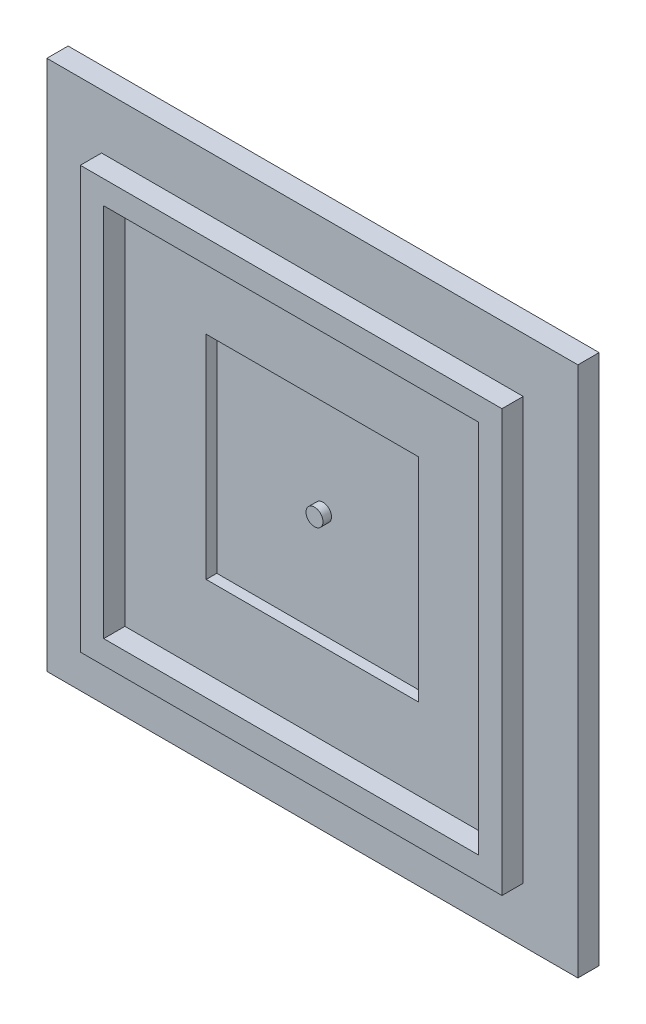
ISO-10303-21;
HEADER;
FILE_DESCRIPTION(('STEP AP214'),'2;1');
FILE_NAME('part.step','',(''),(''),'','','');
FILE_SCHEMA(('AUTOMOTIVE_DESIGN { 1 0 10303 214 1 1 1 1 }'));
ENDSEC;
DATA;
#1=APPLICATION_CONTEXT('core data for automotive mechanical design processes');
#2=APPLICATION_PROTOCOL_DEFINITION('international standard','automotive_design',2000,#1);
#3=PRODUCT_CONTEXT('',#1,'mechanical');
#4=PRODUCT('Part','Part','',(#3));
#5=PRODUCT_RELATED_PRODUCT_CATEGORY('part','',(#4));
#6=PRODUCT_DEFINITION_FORMATION('','',#4);
#7=PRODUCT_DEFINITION_CONTEXT('part definition',#1,'design');
#8=PRODUCT_DEFINITION('design','',#6,#7);
#9=PRODUCT_DEFINITION_SHAPE('','',#8);
#10=(LENGTH_UNIT() NAMED_UNIT(*) SI_UNIT(.MILLI.,.METRE.));
#11=(NAMED_UNIT(*) PLANE_ANGLE_UNIT() SI_UNIT($,.RADIAN.));
#12=(NAMED_UNIT(*) SI_UNIT($,.STERADIAN.) SOLID_ANGLE_UNIT());
#13=UNCERTAINTY_MEASURE_WITH_UNIT(LENGTH_MEASURE(1.E-05),#10,'distance_accuracy_value','');
#14=(GEOMETRIC_REPRESENTATION_CONTEXT(3) GLOBAL_UNCERTAINTY_ASSIGNED_CONTEXT((#13)) GLOBAL_UNIT_ASSIGNED_CONTEXT((#10,
#11,#12)) REPRESENTATION_CONTEXT('',''));
#15=CARTESIAN_POINT('',(0.,0.,0.));
#16=DIRECTION('',(0.,0.,1.));
#17=DIRECTION('',(1.,0.,0.));
#18=AXIS2_PLACEMENT_3D('',#15,#16,#17);
#19=CARTESIAN_POINT('',(0.,0.,0.));
#20=DIRECTION('',(0.,0.,-1.));
#21=DIRECTION('',(-1.,0.,0.));
#22=AXIS2_PLACEMENT_3D('',#19,#20,#21);
#23=PLANE('',#22);
#24=DIRECTION('',(0.,-1.,0.));
#25=VECTOR('',#24,1.);
#26=CARTESIAN_POINT('',(-63.5,63.5,0.));
#27=LINE('',#26,#25);
#28=CARTESIAN_POINT('',(-63.5,63.5,0.));
#29=VERTEX_POINT('',#28);
#30=CARTESIAN_POINT('',(-63.5,-63.5,0.));
#31=VERTEX_POINT('',#30);
#32=EDGE_CURVE('E250',#29,#31,#27,.T.);
#33=ORIENTED_EDGE('',*,*,#32,.T.);
#34=DIRECTION('',(1.,0.,0.));
#35=VECTOR('',#34,1.);
#36=CARTESIAN_POINT('',(63.5,-63.5,0.));
#37=LINE('',#36,#35);
#38=CARTESIAN_POINT('',(63.5,-63.5,0.));
#39=VERTEX_POINT('',#38);
#40=EDGE_CURVE('E267',#31,#39,#37,.T.);
#41=ORIENTED_EDGE('',*,*,#40,.T.);
#42=DIRECTION('',(0.,1.,0.));
#43=VECTOR('',#42,1.);
#44=CARTESIAN_POINT('',(63.5,63.5,0.));
#45=LINE('',#44,#43);
#46=CARTESIAN_POINT('',(63.5,63.5,0.));
#47=VERTEX_POINT('',#46);
#48=EDGE_CURVE('E270',#39,#47,#45,.T.);
#49=ORIENTED_EDGE('',*,*,#48,.T.);
#50=DIRECTION('',(-1.,0.,0.));
#51=VECTOR('',#50,1.);
#52=CARTESIAN_POINT('',(63.5,63.5,0.));
#53=LINE('',#52,#51);
#54=EDGE_CURVE('E255',#47,#29,#53,.T.);
#55=ORIENTED_EDGE('',*,*,#54,.T.);
#56=EDGE_LOOP('',(#33,#41,#49,#55));
#57=FACE_BOUND('',#56,.T.);
#58=DIRECTION('',(1.,0.,0.));
#59=VECTOR('',#58,1.);
#60=CARTESIAN_POINT('',(-50.419,-50.419,0.));
#61=LINE('',#60,#59);
#62=CARTESIAN_POINT('',(-50.419,-50.419,0.));
#63=VERTEX_POINT('',#62);
#64=CARTESIAN_POINT('',(50.419,-50.419,0.));
#65=VERTEX_POINT('',#64);
#66=EDGE_CURVE('E215',#63,#65,#61,.T.);
#67=ORIENTED_EDGE('',*,*,#66,.F.);
#68=DIRECTION('',(0.,-1.,0.));
#69=VECTOR('',#68,1.);
#70=CARTESIAN_POINT('',(-50.419,50.419,0.));
#71=LINE('',#70,#69);
#72=CARTESIAN_POINT('',(-50.419,50.419,0.));
#73=VERTEX_POINT('',#72);
#74=EDGE_CURVE('E224',#73,#63,#71,.T.);
#75=ORIENTED_EDGE('',*,*,#74,.F.);
#76=DIRECTION('',(1.,0.,0.));
#77=VECTOR('',#76,1.);
#78=CARTESIAN_POINT('',(-50.419,50.419,0.));
#79=LINE('',#78,#77);
#80=CARTESIAN_POINT('',(50.419,50.419,0.));
#81=VERTEX_POINT('',#80);
#82=EDGE_CURVE('E237',#73,#81,#79,.T.);
#83=ORIENTED_EDGE('',*,*,#82,.T.);
#84=DIRECTION('',(0.,-1.,0.));
#85=VECTOR('',#84,1.);
#86=CARTESIAN_POINT('',(50.419,50.419,0.));
#87=LINE('',#86,#85);
#88=EDGE_CURVE('E234',#81,#65,#87,.T.);
#89=ORIENTED_EDGE('',*,*,#88,.T.);
#90=EDGE_LOOP('',(#67,#75,#83,#89));
#91=FACE_BOUND('',#90,.T.);
#92=ADVANCED_FACE('F35',(#57,#91),#23,.F.);
#93=CARTESIAN_POINT('',(-63.5,63.5,-5.08));
#94=DIRECTION('',(-1.,0.,0.));
#95=DIRECTION('',(0.,-1.,0.));
#96=AXIS2_PLACEMENT_3D('',#93,#94,#95);
#97=PLANE('',#96);
#98=ORIENTED_EDGE('',*,*,#32,.F.);
#99=DIRECTION('',(0.,0.,1.));
#100=VECTOR('',#99,1.);
#101=CARTESIAN_POINT('',(-63.5,63.5,-5.08));
#102=LINE('',#101,#100);
#103=CARTESIAN_POINT('',(-63.5,63.5,-5.08));
#104=VERTEX_POINT('',#103);
#105=EDGE_CURVE('E43',#104,#29,#102,.T.);
#106=ORIENTED_EDGE('',*,*,#105,.F.);
#107=DIRECTION('',(0.,-1.,0.));
#108=VECTOR('',#107,1.);
#109=CARTESIAN_POINT('',(-63.5,63.5,-5.08));
#110=LINE('',#109,#108);
#111=CARTESIAN_POINT('',(-63.5,-63.5,-5.08));
#112=VERTEX_POINT('',#111);
#113=EDGE_CURVE('E251',#104,#112,#110,.T.);
#114=ORIENTED_EDGE('',*,*,#113,.T.);
#115=DIRECTION('',(0.,0.,1.));
#116=VECTOR('',#115,1.);
#117=CARTESIAN_POINT('',(-63.5,-63.5,-5.08));
#118=LINE('',#117,#116);
#119=EDGE_CURVE('E264',#112,#31,#118,.T.);
#120=ORIENTED_EDGE('',*,*,#119,.T.);
#121=EDGE_LOOP('',(#98,#106,#114,#120));
#122=FACE_BOUND('',#121,.T.);
#123=ADVANCED_FACE('F37',(#122),#97,.T.);
#124=CARTESIAN_POINT('',(63.5,63.5,-5.08));
#125=DIRECTION('',(0.,1.,0.));
#126=DIRECTION('',(-1.,0.,0.));
#127=AXIS2_PLACEMENT_3D('',#124,#125,#126);
#128=PLANE('',#127);
#129=ORIENTED_EDGE('',*,*,#54,.F.);
#130=DIRECTION('',(0.,0.,1.));
#131=VECTOR('',#130,1.);
#132=CARTESIAN_POINT('',(63.5,63.5,-5.08));
#133=LINE('',#132,#131);
#134=CARTESIAN_POINT('',(63.5,63.5,-5.08));
#135=VERTEX_POINT('',#134);
#136=EDGE_CURVE('E276',#135,#47,#133,.T.);
#137=ORIENTED_EDGE('',*,*,#136,.F.);
#138=DIRECTION('',(-1.,0.,0.));
#139=VECTOR('',#138,1.);
#140=CARTESIAN_POINT('',(63.5,63.5,-5.08));
#141=LINE('',#140,#139);
#142=EDGE_CURVE('E261',#135,#104,#141,.T.);
#143=ORIENTED_EDGE('',*,*,#142,.T.);
#144=ORIENTED_EDGE('',*,*,#105,.T.);
#145=EDGE_LOOP('',(#129,#137,#143,#144));
#146=FACE_BOUND('',#145,.T.);
#147=ADVANCED_FACE('F291',(#146),#128,.T.);
#148=CARTESIAN_POINT('',(63.5,63.5,-5.08));
#149=DIRECTION('',(1.,0.,0.));
#150=DIRECTION('',(0.,1.,0.));
#151=AXIS2_PLACEMENT_3D('',#148,#149,#150);
#152=PLANE('',#151);
#153=ORIENTED_EDGE('',*,*,#48,.F.);
#154=DIRECTION('',(0.,0.,1.));
#155=VECTOR('',#154,1.);
#156=CARTESIAN_POINT('',(63.5,-63.5,-5.08));
#157=LINE('',#156,#155);
#158=CARTESIAN_POINT('',(63.5,-63.5,-5.08));
#159=VERTEX_POINT('',#158);
#160=EDGE_CURVE('E278',#159,#39,#157,.T.);
#161=ORIENTED_EDGE('',*,*,#160,.F.);
#162=DIRECTION('',(0.,1.,0.));
#163=VECTOR('',#162,1.);
#164=CARTESIAN_POINT('',(63.5,63.5,-5.08));
#165=LINE('',#164,#163);
#166=EDGE_CURVE('E258',#159,#135,#165,.T.);
#167=ORIENTED_EDGE('',*,*,#166,.T.);
#168=ORIENTED_EDGE('',*,*,#136,.T.);
#169=EDGE_LOOP('',(#153,#161,#167,#168));
#170=FACE_BOUND('',#169,.T.);
#171=ADVANCED_FACE('F297',(#170),#152,.T.);
#172=CARTESIAN_POINT('',(63.5,-63.5,-5.08));
#173=DIRECTION('',(0.,-1.,0.));
#174=DIRECTION('',(1.,0.,0.));
#175=AXIS2_PLACEMENT_3D('',#172,#173,#174);
#176=PLANE('',#175);
#177=ORIENTED_EDGE('',*,*,#40,.F.);
#178=ORIENTED_EDGE('',*,*,#119,.F.);
#179=DIRECTION('',(1.,0.,0.));
#180=VECTOR('',#179,1.);
#181=CARTESIAN_POINT('',(63.5,-63.5,-5.08));
#182=LINE('',#181,#180);
#183=EDGE_CURVE('E254',#112,#159,#182,.T.);
#184=ORIENTED_EDGE('',*,*,#183,.T.);
#185=ORIENTED_EDGE('',*,*,#160,.T.);
#186=EDGE_LOOP('',(#177,#178,#184,#185));
#187=FACE_BOUND('',#186,.T.);
#188=ADVANCED_FACE('F285',(#187),#176,.T.);
#189=CARTESIAN_POINT('',(0.,0.,-5.08));
#190=DIRECTION('',(0.,0.,-1.));
#191=DIRECTION('',(-1.,0.,0.));
#192=AXIS2_PLACEMENT_3D('',#189,#190,#191);
#193=PLANE('',#192);
#194=ORIENTED_EDGE('',*,*,#113,.F.);
#195=ORIENTED_EDGE('',*,*,#142,.F.);
#196=ORIENTED_EDGE('',*,*,#166,.F.);
#197=ORIENTED_EDGE('',*,*,#183,.F.);
#198=EDGE_LOOP('',(#194,#195,#196,#197));
#199=FACE_BOUND('',#198,.T.);
#200=ADVANCED_FACE('F294',(#199),#193,.T.);
#201=CARTESIAN_POINT('',(-50.419,-50.419,5.08));
#202=DIRECTION('',(0.,1.,0.));
#203=DIRECTION('',(0.,0.,1.));
#204=AXIS2_PLACEMENT_3D('',#201,#202,#203);
#205=PLANE('',#204);
#206=ORIENTED_EDGE('',*,*,#66,.T.);
#207=DIRECTION('',(0.,0.,-1.));
#208=VECTOR('',#207,1.);
#209=CARTESIAN_POINT('',(50.419,-50.419,5.08));
#210=LINE('',#209,#208);
#211=CARTESIAN_POINT('',(50.419,-50.419,5.08));
#212=VERTEX_POINT('',#211);
#213=EDGE_CURVE('E247',#212,#65,#210,.T.);
#214=ORIENTED_EDGE('',*,*,#213,.F.);
#215=DIRECTION('',(1.,0.,0.));
#216=VECTOR('',#215,1.);
#217=CARTESIAN_POINT('',(-50.419,-50.419,5.08));
#218=LINE('',#217,#216);
#219=CARTESIAN_POINT('',(-50.419,-50.419,5.08));
#220=VERTEX_POINT('',#219);
#221=EDGE_CURVE('E221',#220,#212,#218,.T.);
#222=ORIENTED_EDGE('',*,*,#221,.F.);
#223=DIRECTION('',(0.,0.,-1.));
#224=VECTOR('',#223,1.);
#225=CARTESIAN_POINT('',(-50.419,-50.419,5.08));
#226=LINE('',#225,#224);
#227=EDGE_CURVE('E232',#220,#63,#226,.T.);
#228=ORIENTED_EDGE('',*,*,#227,.T.);
#229=EDGE_LOOP('',(#206,#214,#222,#228));
#230=FACE_BOUND('',#229,.T.);
#231=ADVANCED_FACE('F313',(#230),#205,.F.);
#232=CARTESIAN_POINT('',(50.419,50.419,5.08));
#233=DIRECTION('',(1.,0.,0.));
#234=DIRECTION('',(0.,1.,0.));
#235=AXIS2_PLACEMENT_3D('',#232,#233,#234);
#236=PLANE('',#235);
#237=ORIENTED_EDGE('',*,*,#88,.F.);
#238=DIRECTION('',(0.,0.,-1.));
#239=VECTOR('',#238,1.);
#240=CARTESIAN_POINT('',(50.419,50.419,5.08));
#241=LINE('',#240,#239);
#242=CARTESIAN_POINT('',(50.419,50.419,5.08));
#243=VERTEX_POINT('',#242);
#244=EDGE_CURVE('E245',#243,#81,#241,.T.);
#245=ORIENTED_EDGE('',*,*,#244,.F.);
#246=DIRECTION('',(0.,-1.,0.));
#247=VECTOR('',#246,1.);
#248=CARTESIAN_POINT('',(50.419,50.419,5.08));
#249=LINE('',#248,#247);
#250=EDGE_CURVE('E223',#243,#212,#249,.T.);
#251=ORIENTED_EDGE('',*,*,#250,.T.);
#252=ORIENTED_EDGE('',*,*,#213,.T.);
#253=EDGE_LOOP('',(#237,#245,#251,#252));
#254=FACE_BOUND('',#253,.T.);
#255=ADVANCED_FACE('F316',(#254),#236,.T.);
#256=CARTESIAN_POINT('',(-50.419,50.419,5.08));
#257=DIRECTION('',(0.,1.,0.));
#258=DIRECTION('',(0.,0.,1.));
#259=AXIS2_PLACEMENT_3D('',#256,#257,#258);
#260=PLANE('',#259);
#261=ORIENTED_EDGE('',*,*,#82,.F.);
#262=DIRECTION('',(0.,0.,-1.));
#263=VECTOR('',#262,1.);
#264=CARTESIAN_POINT('',(-50.419,50.419,5.08));
#265=LINE('',#264,#263);
#266=CARTESIAN_POINT('',(-50.419,50.419,5.08));
#267=VERTEX_POINT('',#266);
#268=EDGE_CURVE('E243',#267,#73,#265,.T.);
#269=ORIENTED_EDGE('',*,*,#268,.F.);
#270=DIRECTION('',(1.,0.,0.));
#271=VECTOR('',#270,1.);
#272=CARTESIAN_POINT('',(-50.419,50.419,5.08));
#273=LINE('',#272,#271);
#274=EDGE_CURVE('E227',#267,#243,#273,.T.);
#275=ORIENTED_EDGE('',*,*,#274,.T.);
#276=ORIENTED_EDGE('',*,*,#244,.T.);
#277=EDGE_LOOP('',(#261,#269,#275,#276));
#278=FACE_BOUND('',#277,.T.);
#279=ADVANCED_FACE('F320',(#278),#260,.T.);
#280=CARTESIAN_POINT('',(-50.419,50.419,5.08));
#281=DIRECTION('',(1.,0.,0.));
#282=DIRECTION('',(0.,1.,0.));
#283=AXIS2_PLACEMENT_3D('',#280,#281,#282);
#284=PLANE('',#283);
#285=ORIENTED_EDGE('',*,*,#74,.T.);
#286=ORIENTED_EDGE('',*,*,#227,.F.);
#287=DIRECTION('',(0.,-1.,0.));
#288=VECTOR('',#287,1.);
#289=CARTESIAN_POINT('',(-50.419,50.419,5.08));
#290=LINE('',#289,#288);
#291=EDGE_CURVE('E230',#267,#220,#290,.T.);
#292=ORIENTED_EDGE('',*,*,#291,.F.);
#293=ORIENTED_EDGE('',*,*,#268,.T.);
#294=EDGE_LOOP('',(#285,#286,#292,#293));
#295=FACE_BOUND('',#294,.T.);
#296=ADVANCED_FACE('F324',(#295),#284,.F.);
#297=CARTESIAN_POINT('',(0.,0.,5.08));
#298=DIRECTION('',(0.,0.,-1.));
#299=DIRECTION('',(-1.,0.,0.));
#300=AXIS2_PLACEMENT_3D('',#297,#298,#299);
#301=PLANE('',#300);
#302=DIRECTION('',(-1.,0.,0.));
#303=VECTOR('',#302,1.);
#304=CARTESIAN_POINT('',(-44.831,44.831,5.08));
#305=LINE('',#304,#303);
#306=CARTESIAN_POINT('',(44.831,44.831,5.08));
#307=VERTEX_POINT('',#306);
#308=CARTESIAN_POINT('',(-44.831,44.831,5.08));
#309=VERTEX_POINT('',#308);
#310=EDGE_CURVE('E205',#307,#309,#305,.T.);
#311=ORIENTED_EDGE('',*,*,#310,.F.);
#312=DIRECTION('',(0.,1.,0.));
#313=VECTOR('',#312,1.);
#314=CARTESIAN_POINT('',(44.831,44.831,5.08));
#315=LINE('',#314,#313);
#316=CARTESIAN_POINT('',(44.831,-44.831,5.08));
#317=VERTEX_POINT('',#316);
#318=EDGE_CURVE('E58',#317,#307,#315,.T.);
#319=ORIENTED_EDGE('',*,*,#318,.F.);
#320=DIRECTION('',(1.,0.,0.));
#321=VECTOR('',#320,1.);
#322=CARTESIAN_POINT('',(-44.831,-44.831,5.08));
#323=LINE('',#322,#321);
#324=CARTESIAN_POINT('',(-44.831,-44.831,5.08));
#325=VERTEX_POINT('',#324);
#326=EDGE_CURVE('E194',#325,#317,#323,.T.);
#327=ORIENTED_EDGE('',*,*,#326,.F.);
#328=DIRECTION('',(0.,-1.,0.));
#329=VECTOR('',#328,1.);
#330=CARTESIAN_POINT('',(-44.831,44.831,5.08));
#331=LINE('',#330,#329);
#332=EDGE_CURVE('E208',#309,#325,#331,.T.);
#333=ORIENTED_EDGE('',*,*,#332,.F.);
#334=EDGE_LOOP('',(#311,#319,#327,#333));
#335=FACE_BOUND('',#334,.T.);
#336=ORIENTED_EDGE('',*,*,#221,.T.);
#337=ORIENTED_EDGE('',*,*,#250,.F.);
#338=ORIENTED_EDGE('',*,*,#274,.F.);
#339=ORIENTED_EDGE('',*,*,#291,.T.);
#340=EDGE_LOOP('',(#336,#337,#338,#339));
#341=FACE_BOUND('',#340,.T.);
#342=ADVANCED_FACE('F328',(#335,#341),#301,.F.);
#343=CARTESIAN_POINT('',(44.831,44.831,0.));
#344=DIRECTION('',(1.,0.,0.));
#345=DIRECTION('',(0.,1.,0.));
#346=AXIS2_PLACEMENT_3D('',#343,#344,#345);
#347=PLANE('',#346);
#348=ORIENTED_EDGE('',*,*,#318,.T.);
#349=DIRECTION('',(0.,0.,1.));
#350=VECTOR('',#349,1.);
#351=CARTESIAN_POINT('',(44.831,44.831,0.));
#352=LINE('',#351,#350);
#353=CARTESIAN_POINT('',(44.831,44.831,0.));
#354=VERTEX_POINT('',#353);
#355=EDGE_CURVE('E203',#354,#307,#352,.T.);
#356=ORIENTED_EDGE('',*,*,#355,.F.);
#357=DIRECTION('',(0.,1.,0.));
#358=VECTOR('',#357,1.);
#359=CARTESIAN_POINT('',(44.831,44.831,0.));
#360=LINE('',#359,#358);
#361=CARTESIAN_POINT('',(44.831,-44.831,0.));
#362=VERTEX_POINT('',#361);
#363=EDGE_CURVE('E190',#362,#354,#360,.T.);
#364=ORIENTED_EDGE('',*,*,#363,.F.);
#365=DIRECTION('',(0.,0.,1.));
#366=VECTOR('',#365,1.);
#367=CARTESIAN_POINT('',(44.831,-44.831,0.));
#368=LINE('',#367,#366);
#369=EDGE_CURVE('E213',#362,#317,#368,.T.);
#370=ORIENTED_EDGE('',*,*,#369,.T.);
#371=EDGE_LOOP('',(#348,#356,#364,#370));
#372=FACE_BOUND('',#371,.T.);
#373=ADVANCED_FACE('F332',(#372),#347,.F.);
#374=CARTESIAN_POINT('',(-44.831,-44.831,0.));
#375=DIRECTION('',(0.,-1.,0.));
#376=DIRECTION('',(0.,0.,-1.));
#377=AXIS2_PLACEMENT_3D('',#374,#375,#376);
#378=PLANE('',#377);
#379=ORIENTED_EDGE('',*,*,#326,.T.);
#380=ORIENTED_EDGE('',*,*,#369,.F.);
#381=DIRECTION('',(1.,0.,0.));
#382=VECTOR('',#381,1.);
#383=CARTESIAN_POINT('',(-44.831,-44.831,0.));
#384=LINE('',#383,#382);
#385=CARTESIAN_POINT('',(-44.831,-44.831,0.));
#386=VERTEX_POINT('',#385);
#387=EDGE_CURVE('E200',#386,#362,#384,.T.);
#388=ORIENTED_EDGE('',*,*,#387,.F.);
#389=DIRECTION('',(0.,0.,1.));
#390=VECTOR('',#389,1.);
#391=CARTESIAN_POINT('',(-44.831,-44.831,0.));
#392=LINE('',#391,#390);
#393=EDGE_CURVE('E216',#386,#325,#392,.T.);
#394=ORIENTED_EDGE('',*,*,#393,.T.);
#395=EDGE_LOOP('',(#379,#380,#388,#394));
#396=FACE_BOUND('',#395,.T.);
#397=ADVANCED_FACE('F336',(#396),#378,.F.);
#398=CARTESIAN_POINT('',(-44.831,44.831,0.));
#399=DIRECTION('',(-1.,0.,0.));
#400=DIRECTION('',(0.,-1.,0.));
#401=AXIS2_PLACEMENT_3D('',#398,#399,#400);
#402=PLANE('',#401);
#403=ORIENTED_EDGE('',*,*,#332,.T.);
#404=ORIENTED_EDGE('',*,*,#393,.F.);
#405=DIRECTION('',(0.,-1.,0.));
#406=VECTOR('',#405,1.);
#407=CARTESIAN_POINT('',(-44.831,44.831,0.));
#408=LINE('',#407,#406);
#409=CARTESIAN_POINT('',(-44.831,44.831,0.));
#410=VERTEX_POINT('',#409);
#411=EDGE_CURVE('E197',#410,#386,#408,.T.);
#412=ORIENTED_EDGE('',*,*,#411,.F.);
#413=DIRECTION('',(0.,0.,1.));
#414=VECTOR('',#413,1.);
#415=CARTESIAN_POINT('',(-44.831,44.831,0.));
#416=LINE('',#415,#414);
#417=EDGE_CURVE('E218',#410,#309,#416,.T.);
#418=ORIENTED_EDGE('',*,*,#417,.T.);
#419=EDGE_LOOP('',(#403,#404,#412,#418));
#420=FACE_BOUND('',#419,.T.);
#421=ADVANCED_FACE('F341',(#420),#402,.F.);
#422=CARTESIAN_POINT('',(-44.831,44.831,0.));
#423=DIRECTION('',(0.,1.,0.));
#424=DIRECTION('',(0.,0.,1.));
#425=AXIS2_PLACEMENT_3D('',#422,#423,#424);
#426=PLANE('',#425);
#427=ORIENTED_EDGE('',*,*,#310,.T.);
#428=ORIENTED_EDGE('',*,*,#417,.F.);
#429=DIRECTION('',(-1.,0.,0.));
#430=VECTOR('',#429,1.);
#431=CARTESIAN_POINT('',(-44.831,44.831,0.));
#432=LINE('',#431,#430);
#433=EDGE_CURVE('E193',#354,#410,#432,.T.);
#434=ORIENTED_EDGE('',*,*,#433,.F.);
#435=ORIENTED_EDGE('',*,*,#355,.T.);
#436=EDGE_LOOP('',(#427,#428,#434,#435));
#437=FACE_BOUND('',#436,.T.);
#438=ADVANCED_FACE('F337',(#437),#426,.F.);
#439=CARTESIAN_POINT('',(0.,0.,0.));
#440=DIRECTION('',(0.,0.,1.));
#441=DIRECTION('',(1.,0.,0.));
#442=AXIS2_PLACEMENT_3D('',#439,#440,#441);
#443=PLANE('',#442);
#444=DIRECTION('',(0.,-1.,0.));
#445=VECTOR('',#444,1.);
#446=CARTESIAN_POINT('',(-25.4,25.4,0.));
#447=LINE('',#446,#445);
#448=CARTESIAN_POINT('',(-25.4,25.4,0.));
#449=VERTEX_POINT('',#448);
#450=CARTESIAN_POINT('',(-25.4,-25.4,0.));
#451=VERTEX_POINT('',#450);
#452=EDGE_CURVE('E155',#449,#451,#447,.T.);
#453=ORIENTED_EDGE('',*,*,#452,.F.);
#454=DIRECTION('',(-1.,0.,0.));
#455=VECTOR('',#454,1.);
#456=CARTESIAN_POINT('',(25.4,25.4,0.));
#457=LINE('',#456,#455);
#458=CARTESIAN_POINT('',(25.4,25.4,0.));
#459=VERTEX_POINT('',#458);
#460=EDGE_CURVE('E172',#459,#449,#457,.T.);
#461=ORIENTED_EDGE('',*,*,#460,.F.);
#462=DIRECTION('',(0.,1.,0.));
#463=VECTOR('',#462,1.);
#464=CARTESIAN_POINT('',(25.4,25.4,0.));
#465=LINE('',#464,#463);
#466=CARTESIAN_POINT('',(25.4,-25.4,0.));
#467=VERTEX_POINT('',#466);
#468=EDGE_CURVE('E50',#467,#459,#465,.T.);
#469=ORIENTED_EDGE('',*,*,#468,.F.);
#470=DIRECTION('',(1.,0.,0.));
#471=VECTOR('',#470,1.);
#472=CARTESIAN_POINT('',(25.4,-25.4,0.));
#473=LINE('',#472,#471);
#474=EDGE_CURVE('E182',#451,#467,#473,.T.);
#475=ORIENTED_EDGE('',*,*,#474,.F.);
#476=EDGE_LOOP('',(#453,#461,#469,#475));
#477=FACE_BOUND('',#476,.T.);
#478=ORIENTED_EDGE('',*,*,#363,.T.);
#479=ORIENTED_EDGE('',*,*,#433,.T.);
#480=ORIENTED_EDGE('',*,*,#411,.T.);
#481=ORIENTED_EDGE('',*,*,#387,.T.);
#482=EDGE_LOOP('',(#478,#479,#480,#481));
#483=FACE_BOUND('',#482,.T.);
#484=ADVANCED_FACE('F340',(#477,#483),#443,.T.);
#485=CARTESIAN_POINT('',(-25.4,25.4,-2.54));
#486=DIRECTION('',(-1.,0.,0.));
#487=DIRECTION('',(0.,-1.,0.));
#488=AXIS2_PLACEMENT_3D('',#485,#486,#487);
#489=PLANE('',#488);
#490=ORIENTED_EDGE('',*,*,#452,.T.);
#491=DIRECTION('',(0.,0.,1.));
#492=VECTOR('',#491,1.);
#493=CARTESIAN_POINT('',(-25.4,-25.4,-2.54));
#494=LINE('',#493,#492);
#495=CARTESIAN_POINT('',(-25.4,-25.4,-2.54));
#496=VERTEX_POINT('',#495);
#497=EDGE_CURVE('E148',#496,#451,#494,.T.);
#498=ORIENTED_EDGE('',*,*,#497,.F.);
#499=DIRECTION('',(0.,-1.,0.));
#500=VECTOR('',#499,1.);
#501=CARTESIAN_POINT('',(-25.4,25.4,-2.54));
#502=LINE('',#501,#500);
#503=CARTESIAN_POINT('',(-25.4,25.4,-2.54));
#504=VERTEX_POINT('',#503);
#505=EDGE_CURVE('E152',#504,#496,#502,.T.);
#506=ORIENTED_EDGE('',*,*,#505,.F.);
#507=DIRECTION('',(0.,0.,1.));
#508=VECTOR('',#507,1.);
#509=CARTESIAN_POINT('',(-25.4,25.4,-2.54));
#510=LINE('',#509,#508);
#511=EDGE_CURVE('E185',#504,#449,#510,.T.);
#512=ORIENTED_EDGE('',*,*,#511,.T.);
#513=EDGE_LOOP('',(#490,#498,#506,#512));
#514=FACE_BOUND('',#513,.T.);
#515=ADVANCED_FACE('F150',(#514),#489,.F.);
#516=CARTESIAN_POINT('',(25.4,25.4,-2.54));
#517=DIRECTION('',(0.,1.,0.));
#518=DIRECTION('',(-1.,0.,0.));
#519=AXIS2_PLACEMENT_3D('',#516,#517,#518);
#520=PLANE('',#519);
#521=ORIENTED_EDGE('',*,*,#460,.T.);
#522=ORIENTED_EDGE('',*,*,#511,.F.);
#523=DIRECTION('',(-1.,0.,0.));
#524=VECTOR('',#523,1.);
#525=CARTESIAN_POINT('',(25.4,25.4,-2.54));
#526=LINE('',#525,#524);
#527=CARTESIAN_POINT('',(25.4,25.4,-2.54));
#528=VERTEX_POINT('',#527);
#529=EDGE_CURVE('E160',#528,#504,#526,.T.);
#530=ORIENTED_EDGE('',*,*,#529,.F.);
#531=DIRECTION('',(0.,0.,1.));
#532=VECTOR('',#531,1.);
#533=CARTESIAN_POINT('',(25.4,25.4,-2.54));
#534=LINE('',#533,#532);
#535=EDGE_CURVE('E187',#528,#459,#534,.T.);
#536=ORIENTED_EDGE('',*,*,#535,.T.);
#537=EDGE_LOOP('',(#521,#522,#530,#536));
#538=FACE_BOUND('',#537,.T.);
#539=ADVANCED_FACE('F354',(#538),#520,.F.);
#540=CARTESIAN_POINT('',(25.4,25.4,-2.54));
#541=DIRECTION('',(1.,0.,0.));
#542=DIRECTION('',(0.,1.,0.));
#543=AXIS2_PLACEMENT_3D('',#540,#541,#542);
#544=PLANE('',#543);
#545=ORIENTED_EDGE('',*,*,#468,.T.);
#546=ORIENTED_EDGE('',*,*,#535,.F.);
#547=DIRECTION('',(0.,1.,0.));
#548=VECTOR('',#547,1.);
#549=CARTESIAN_POINT('',(25.4,25.4,-2.54));
#550=LINE('',#549,#548);
#551=CARTESIAN_POINT('',(25.4,-25.4,-2.54));
#552=VERTEX_POINT('',#551);
#553=EDGE_CURVE('E168',#552,#528,#550,.T.);
#554=ORIENTED_EDGE('',*,*,#553,.F.);
#555=DIRECTION('',(0.,0.,1.));
#556=VECTOR('',#555,1.);
#557=CARTESIAN_POINT('',(25.4,-25.4,-2.54));
#558=LINE('',#557,#556);
#559=EDGE_CURVE('E159',#552,#467,#558,.T.);
#560=ORIENTED_EDGE('',*,*,#559,.T.);
#561=EDGE_LOOP('',(#545,#546,#554,#560));
#562=FACE_BOUND('',#561,.T.);
#563=ADVANCED_FACE('F357',(#562),#544,.F.);
#564=CARTESIAN_POINT('',(25.4,-25.4,-2.54));
#565=DIRECTION('',(0.,-1.,0.));
#566=DIRECTION('',(1.,0.,0.));
#567=AXIS2_PLACEMENT_3D('',#564,#565,#566);
#568=PLANE('',#567);
#569=ORIENTED_EDGE('',*,*,#474,.T.);
#570=ORIENTED_EDGE('',*,*,#559,.F.);
#571=DIRECTION('',(1.,0.,0.));
#572=VECTOR('',#571,1.);
#573=CARTESIAN_POINT('',(25.4,-25.4,-2.54));
#574=LINE('',#573,#572);
#575=EDGE_CURVE('E163',#496,#552,#574,.T.);
#576=ORIENTED_EDGE('',*,*,#575,.F.);
#577=ORIENTED_EDGE('',*,*,#497,.T.);
#578=EDGE_LOOP('',(#569,#570,#576,#577));
#579=FACE_BOUND('',#578,.T.);
#580=ADVANCED_FACE('F164',(#579),#568,.F.);
#581=CARTESIAN_POINT('',(0.,0.,-2.54));
#582=DIRECTION('',(0.,0.,-1.));
#583=DIRECTION('',(-1.,0.,0.));
#584=AXIS2_PLACEMENT_3D('',#581,#582,#583);
#585=PLANE('',#584);
#586=CARTESIAN_POINT('',(0.,0.,-2.54));
#587=DIRECTION('',(0.,0.,-1.));
#588=DIRECTION('',(-1.,0.,0.));
#589=AXIS2_PLACEMENT_3D('',#586,#587,#588);
#590=CIRCLE('',#589,2.032);
#591=CARTESIAN_POINT('',(-2.032,0.,-2.54));
#592=VERTEX_POINT('',#591);
#593=EDGE_CURVE('E11',#592,#592,#590,.F.);
#594=ORIENTED_EDGE('',*,*,#593,.F.);
#595=EDGE_LOOP('',(#594));
#596=FACE_BOUND('',#595,.T.);
#597=ORIENTED_EDGE('',*,*,#505,.T.);
#598=ORIENTED_EDGE('',*,*,#575,.T.);
#599=ORIENTED_EDGE('',*,*,#553,.T.);
#600=ORIENTED_EDGE('',*,*,#529,.T.);
#601=EDGE_LOOP('',(#597,#598,#599,#600));
#602=FACE_BOUND('',#601,.T.);
#603=ADVANCED_FACE('F170',(#596,#602),#585,.F.);
#604=CARTESIAN_POINT('',(0.,0.,-0.508));
#605=DIRECTION('',(0.,0.,-1.));
#606=DIRECTION('',(-1.,0.,0.));
#607=AXIS2_PLACEMENT_3D('',#604,#605,#606);
#608=CYLINDRICAL_SURFACE('',#607,2.032);
#609=CARTESIAN_POINT('',(0.,0.,-0.508));
#610=DIRECTION('',(0.,0.,1.));
#611=DIRECTION('',(1.,0.,0.));
#612=AXIS2_PLACEMENT_3D('',#609,#610,#611);
#613=CIRCLE('',#612,2.032);
#614=CARTESIAN_POINT('',(2.032,0.,-0.508));
#615=VERTEX_POINT('',#614);
#616=EDGE_CURVE('E177',#615,#615,#613,.T.);
#617=ORIENTED_EDGE('',*,*,#616,.F.);
#618=EDGE_LOOP('',(#617));
#619=FACE_BOUND('',#618,.T.);
#620=ORIENTED_EDGE('',*,*,#593,.T.);
#621=EDGE_LOOP('',(#620));
#622=FACE_BOUND('',#621,.T.);
#623=ADVANCED_FACE('F365',(#619,#622),#608,.T.);
#624=CARTESIAN_POINT('',(0.,0.,-0.508));
#625=DIRECTION('',(0.,0.,1.));
#626=DIRECTION('',(1.,0.,0.));
#627=AXIS2_PLACEMENT_3D('',#624,#625,#626);
#628=PLANE('',#627);
#629=ORIENTED_EDGE('',*,*,#616,.T.);
#630=EDGE_LOOP('',(#629));
#631=FACE_BOUND('',#630,.T.);
#632=ADVANCED_FACE('F369',(#631),#628,.T.);
#633=CLOSED_SHELL('',(#92,#123,#147,#171,#188,#200,#231,#255,#279,#296,#342,#373,#397,#421,#438,
#484,#515,#539,#563,#580,#603,#623,#632));
#634=MANIFOLD_SOLID_BREP('B2',#633);
#635=ADVANCED_BREP_SHAPE_REPRESENTATION('',(#18,#634),#14);
#636=SHAPE_DEFINITION_REPRESENTATION(#9,#635);
ENDSEC;
END-ISO-10303-21;
